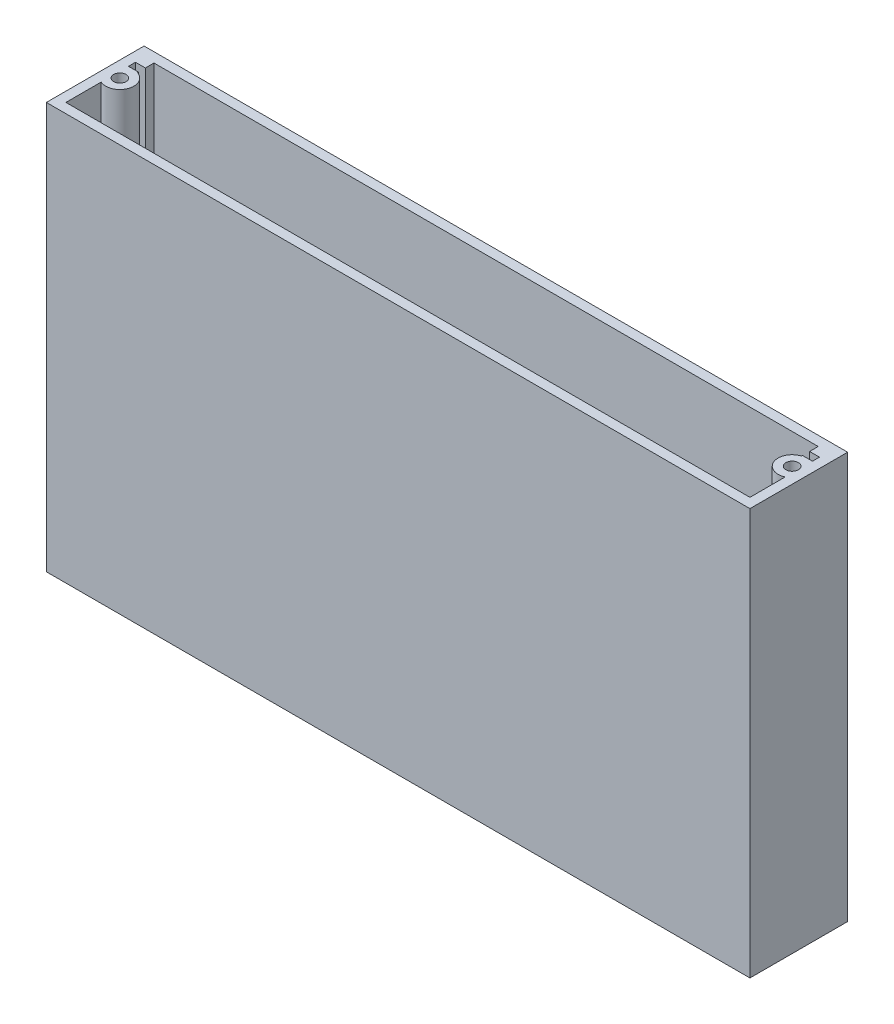
ISO-10303-21;
HEADER;
FILE_DESCRIPTION(('STEP AP214'),'2;1');
FILE_NAME('part.step','',(''),(''),'','','');
FILE_SCHEMA(('AUTOMOTIVE_DESIGN { 1 0 10303 214 1 1 1 1 }'));
ENDSEC;
DATA;
#1=APPLICATION_CONTEXT('core data for automotive mechanical design processes');
#2=APPLICATION_PROTOCOL_DEFINITION('international standard','automotive_design',2000,#1);
#3=PRODUCT_CONTEXT('',#1,'mechanical');
#4=PRODUCT('Part','Part','',(#3));
#5=PRODUCT_RELATED_PRODUCT_CATEGORY('part','',(#4));
#6=PRODUCT_DEFINITION_FORMATION('','',#4);
#7=PRODUCT_DEFINITION_CONTEXT('part definition',#1,'design');
#8=PRODUCT_DEFINITION('design','',#6,#7);
#9=PRODUCT_DEFINITION_SHAPE('','',#8);
#10=(LENGTH_UNIT() NAMED_UNIT(*) SI_UNIT(.MILLI.,.METRE.));
#11=(NAMED_UNIT(*) PLANE_ANGLE_UNIT() SI_UNIT($,.RADIAN.));
#12=(NAMED_UNIT(*) SI_UNIT($,.STERADIAN.) SOLID_ANGLE_UNIT());
#13=UNCERTAINTY_MEASURE_WITH_UNIT(LENGTH_MEASURE(1.E-05),#10,'distance_accuracy_value','');
#14=(GEOMETRIC_REPRESENTATION_CONTEXT(3) GLOBAL_UNCERTAINTY_ASSIGNED_CONTEXT((#13)) GLOBAL_UNIT_ASSIGNED_CONTEXT((#10,
#11,#12)) REPRESENTATION_CONTEXT('',''));
#15=CARTESIAN_POINT('',(0.,0.,0.));
#16=DIRECTION('',(0.,0.,1.));
#17=DIRECTION('',(1.,0.,0.));
#18=AXIS2_PLACEMENT_3D('',#15,#16,#17);
#19=CARTESIAN_POINT('',(225.425,3.17500000000001,-3.175));
#20=DIRECTION('',(1.,0.,0.));
#21=DIRECTION('',(0.,0.,-1.));
#22=AXIS2_PLACEMENT_3D('',#19,#20,#21);
#23=PLANE('',#22);
#24=DIRECTION('',(0.,-1.,0.));
#25=VECTOR('',#24,1.);
#26=CARTESIAN_POINT('',(225.425,145.01156881434,-14.6397806843238));
#27=LINE('',#26,#25);
#28=CARTESIAN_POINT('',(225.425,3.17500000000001,-14.6397806843238));
#29=VERTEX_POINT('',#28);
#30=CARTESIAN_POINT('',(225.425,132.08,-14.6397806843238));
#31=VERTEX_POINT('',#30);
#32=EDGE_CURVE('E174',#29,#31,#27,.F.);
#33=ORIENTED_EDGE('',*,*,#32,.F.);
#34=DIRECTION('',(0.,0.,-1.));
#35=VECTOR('',#34,1.);
#36=CARTESIAN_POINT('',(225.425,3.17500000000001,-3.175));
#37=LINE('',#36,#35);
#38=CARTESIAN_POINT('',(225.425,3.17500000000001,-3.175));
#39=VERTEX_POINT('',#38);
#40=EDGE_CURVE('E326',#39,#29,#37,.T.);
#41=ORIENTED_EDGE('',*,*,#40,.F.);
#42=DIRECTION('',(0.,1.,0.));
#43=VECTOR('',#42,1.);
#44=CARTESIAN_POINT('',(225.425,3.17500000000001,-3.175));
#45=LINE('',#44,#43);
#46=CARTESIAN_POINT('',(225.425,132.08,-3.175));
#47=VERTEX_POINT('',#46);
#48=EDGE_CURVE('E195',#39,#47,#45,.T.);
#49=ORIENTED_EDGE('',*,*,#48,.T.);
#50=DIRECTION('',(0.,0.,-1.));
#51=VECTOR('',#50,1.);
#52=CARTESIAN_POINT('',(225.425,132.08,-3.175));
#53=LINE('',#52,#51);
#54=EDGE_CURVE('E191',#47,#31,#53,.T.);
#55=ORIENTED_EDGE('',*,*,#54,.T.);
#56=EDGE_LOOP('',(#33,#41,#49,#55));
#57=FACE_BOUND('',#56,.T.);
#58=ADVANCED_FACE('F37',(#57),#23,.F.);
#59=CARTESIAN_POINT('',(222.208000312942,138.092943288152,-18.415));
#60=DIRECTION('',(-1.,0.,0.));
#61=DIRECTION('',(0.,0.,1.));
#62=AXIS2_PLACEMENT_3D('',#59,#60,#61);
#63=PLANE('',#62);
#64=DIRECTION('',(0.,0.,-1.));
#65=VECTOR('',#64,1.);
#66=CARTESIAN_POINT('',(222.208000312942,3.17500000000001,-18.415));
#67=LINE('',#66,#65);
#68=CARTESIAN_POINT('',(222.208000312942,3.17500000000001,-23.1757078465532));
#69=VERTEX_POINT('',#68);
#70=CARTESIAN_POINT('',(222.208000312942,3.17500000000001,-23.495));
#71=VERTEX_POINT('',#70);
#72=EDGE_CURVE('E262',#69,#71,#67,.T.);
#73=ORIENTED_EDGE('',*,*,#72,.F.);
#74=DIRECTION('',(0.,-1.,0.));
#75=VECTOR('',#74,1.);
#76=CARTESIAN_POINT('',(222.208000312942,145.01156881434,-23.1757078465532));
#77=LINE('',#76,#75);
#78=CARTESIAN_POINT('',(222.208000312942,132.08,-23.1757078465532));
#79=VERTEX_POINT('',#78);
#80=EDGE_CURVE('E11',#69,#79,#77,.F.);
#81=ORIENTED_EDGE('',*,*,#80,.T.);
#82=DIRECTION('',(0.,0.,1.));
#83=VECTOR('',#82,1.);
#84=CARTESIAN_POINT('',(222.208000312942,132.08,-18.415));
#85=LINE('',#84,#83);
#86=CARTESIAN_POINT('',(222.208000312942,132.08,-23.495));
#87=VERTEX_POINT('',#86);
#88=EDGE_CURVE('E193',#87,#79,#85,.T.);
#89=ORIENTED_EDGE('',*,*,#88,.F.);
#90=DIRECTION('',(0.,-1.,0.));
#91=VECTOR('',#90,1.);
#92=CARTESIAN_POINT('',(222.208000312942,138.092943288152,-23.495));
#93=LINE('',#92,#91);
#94=EDGE_CURVE('E264',#87,#71,#93,.T.);
#95=ORIENTED_EDGE('',*,*,#94,.T.);
#96=EDGE_LOOP('',(#73,#81,#89,#95));
#97=FACE_BOUND('',#96,.T.);
#98=ADVANCED_FACE('F341',(#97),#63,.T.);
#99=CARTESIAN_POINT('',(3.175,3.17500000000001,-3.175));
#100=DIRECTION('',(-1.,0.,0.));
#101=DIRECTION('',(0.,0.,1.));
#102=AXIS2_PLACEMENT_3D('',#99,#100,#101);
#103=PLANE('',#102);
#104=DIRECTION('',(0.,-1.,0.));
#105=VECTOR('',#104,1.);
#106=CARTESIAN_POINT('',(3.175,145.01156881434,-14.6397806843238));
#107=LINE('',#106,#105);
#108=CARTESIAN_POINT('',(3.175,132.08,-14.6397806843238));
#109=VERTEX_POINT('',#108);
#110=CARTESIAN_POINT('',(3.175,3.17500000000001,-14.6397806843238));
#111=VERTEX_POINT('',#110);
#112=EDGE_CURVE('E59',#109,#111,#107,.T.);
#113=ORIENTED_EDGE('',*,*,#112,.F.);
#114=DIRECTION('',(0.,0.,1.));
#115=VECTOR('',#114,1.);
#116=CARTESIAN_POINT('',(3.175,132.08,-3.175));
#117=LINE('',#116,#115);
#118=CARTESIAN_POINT('',(3.175,132.08,-3.175));
#119=VERTEX_POINT('',#118);
#120=EDGE_CURVE('E250',#109,#119,#117,.T.);
#121=ORIENTED_EDGE('',*,*,#120,.T.);
#122=DIRECTION('',(0.,1.,0.));
#123=VECTOR('',#122,1.);
#124=CARTESIAN_POINT('',(3.175,3.17500000000001,-3.175));
#125=LINE('',#124,#123);
#126=CARTESIAN_POINT('',(3.175,3.17500000000001,-3.175));
#127=VERTEX_POINT('',#126);
#128=EDGE_CURVE('E208',#127,#119,#125,.T.);
#129=ORIENTED_EDGE('',*,*,#128,.F.);
#130=DIRECTION('',(0.,0.,1.));
#131=VECTOR('',#130,1.);
#132=CARTESIAN_POINT('',(3.175,3.17500000000001,-3.175));
#133=LINE('',#132,#131);
#134=EDGE_CURVE('E200',#111,#127,#133,.T.);
#135=ORIENTED_EDGE('',*,*,#134,.F.);
#136=EDGE_LOOP('',(#113,#121,#129,#135));
#137=FACE_BOUND('',#136,.T.);
#138=ADVANCED_FACE('F332',(#137),#103,.F.);
#139=CARTESIAN_POINT('',(6.39199968705793,138.092943288152,-18.415));
#140=DIRECTION('',(-1.,0.,0.));
#141=DIRECTION('',(0.,0.,1.));
#142=AXIS2_PLACEMENT_3D('',#139,#140,#141);
#143=PLANE('',#142);
#144=DIRECTION('',(0.,-1.,0.));
#145=VECTOR('',#144,1.);
#146=CARTESIAN_POINT('',(6.39199968705793,145.01156881434,-23.1757078465532));
#147=LINE('',#146,#145);
#148=CARTESIAN_POINT('',(6.39199968705793,3.17500000000001,-23.1757078465532));
#149=VERTEX_POINT('',#148);
#150=CARTESIAN_POINT('',(6.39199968705793,132.08,-23.1757078465532));
#151=VERTEX_POINT('',#150);
#152=EDGE_CURVE('E45',#149,#151,#147,.F.);
#153=ORIENTED_EDGE('',*,*,#152,.F.);
#154=DIRECTION('',(0.,0.,-1.));
#155=VECTOR('',#154,1.);
#156=CARTESIAN_POINT('',(6.39199968705793,3.17500000000001,-18.415));
#157=LINE('',#156,#155);
#158=CARTESIAN_POINT('',(6.39199968705793,3.17500000000001,-23.495));
#159=VERTEX_POINT('',#158);
#160=EDGE_CURVE('E285',#149,#159,#157,.T.);
#161=ORIENTED_EDGE('',*,*,#160,.T.);
#162=DIRECTION('',(0.,-1.,0.));
#163=VECTOR('',#162,1.);
#164=CARTESIAN_POINT('',(6.39199968705793,138.092943288152,-23.495));
#165=LINE('',#164,#163);
#166=CARTESIAN_POINT('',(6.39199968705793,132.08,-23.495));
#167=VERTEX_POINT('',#166);
#168=EDGE_CURVE('E295',#167,#159,#165,.T.);
#169=ORIENTED_EDGE('',*,*,#168,.F.);
#170=DIRECTION('',(0.,0.,1.));
#171=VECTOR('',#170,1.);
#172=CARTESIAN_POINT('',(6.39199968705793,132.08,-18.415));
#173=LINE('',#172,#171);
#174=EDGE_CURVE('E248',#167,#151,#173,.T.);
#175=ORIENTED_EDGE('',*,*,#174,.T.);
#176=EDGE_LOOP('',(#153,#161,#169,#175));
#177=FACE_BOUND('',#176,.T.);
#178=ADVANCED_FACE('F380',(#177),#143,.F.);
#179=CARTESIAN_POINT('',(225.425,3.17500000000001,-23.495));
#180=VERTEX_POINT('',#179);
#181=CARTESIAN_POINT('',(225.425,3.17500000000001,-25.781));
#182=VERTEX_POINT('',#181);
#183=EDGE_CURVE('E325',#180,#182,#37,.T.);
#184=ORIENTED_EDGE('',*,*,#183,.F.);
#185=DIRECTION('',(0.,-1.,0.));
#186=VECTOR('',#185,1.);
#187=CARTESIAN_POINT('',(225.425,138.092943288152,-23.495));
#188=LINE('',#187,#186);
#189=CARTESIAN_POINT('',(225.425,132.08,-23.495));
#190=VERTEX_POINT('',#189);
#191=EDGE_CURVE('E258',#190,#180,#188,.T.);
#192=ORIENTED_EDGE('',*,*,#191,.F.);
#193=CARTESIAN_POINT('',(225.425,132.08,-25.781));
#194=VERTEX_POINT('',#193);
#195=EDGE_CURVE('E198',#190,#194,#53,.T.);
#196=ORIENTED_EDGE('',*,*,#195,.T.);
#197=DIRECTION('',(0.,-1.,0.));
#198=VECTOR('',#197,1.);
#199=CARTESIAN_POINT('',(225.425,138.092943288152,-25.781));
#200=LINE('',#199,#198);
#201=EDGE_CURVE('E276',#194,#182,#200,.T.);
#202=ORIENTED_EDGE('',*,*,#201,.T.);
#203=EDGE_LOOP('',(#184,#192,#196,#202));
#204=FACE_BOUND('',#203,.T.);
#205=ADVANCED_FACE('F350',(#204),#23,.F.);
#206=DIRECTION('',(0.,-1.,0.));
#207=VECTOR('',#206,1.);
#208=CARTESIAN_POINT('',(3.175,138.092943288152,-23.495));
#209=LINE('',#208,#207);
#210=CARTESIAN_POINT('',(3.175,132.08,-23.495));
#211=VERTEX_POINT('',#210);
#212=CARTESIAN_POINT('',(3.175,3.17500000000001,-23.495));
#213=VERTEX_POINT('',#212);
#214=EDGE_CURVE('E293',#211,#213,#209,.T.);
#215=ORIENTED_EDGE('',*,*,#214,.T.);
#216=CARTESIAN_POINT('',(3.175,3.17500000000001,-25.781));
#217=VERTEX_POINT('',#216);
#218=EDGE_CURVE('E319',#217,#213,#133,.T.);
#219=ORIENTED_EDGE('',*,*,#218,.F.);
#220=DIRECTION('',(0.,-1.,0.));
#221=VECTOR('',#220,1.);
#222=CARTESIAN_POINT('',(3.175,138.092943288152,-25.781));
#223=LINE('',#222,#221);
#224=CARTESIAN_POINT('',(3.175,132.08,-25.781));
#225=VERTEX_POINT('',#224);
#226=EDGE_CURVE('E303',#225,#217,#223,.T.);
#227=ORIENTED_EDGE('',*,*,#226,.F.);
#228=EDGE_CURVE('E328',#225,#211,#117,.T.);
#229=ORIENTED_EDGE('',*,*,#228,.T.);
#230=EDGE_LOOP('',(#215,#219,#227,#229));
#231=FACE_BOUND('',#230,.T.);
#232=ADVANCED_FACE('F375',(#231),#103,.F.);
#233=CARTESIAN_POINT('',(0.,3.17500000000001,0.));
#234=DIRECTION('',(0.,-1.,0.));
#235=DIRECTION('',(0.,0.,-1.));
#236=AXIS2_PLACEMENT_3D('',#233,#234,#235);
#237=PLANE('',#236);
#238=CARTESIAN_POINT('',(223.52,3.17500000000001,-18.796));
#239=DIRECTION('',(0.,1.,0.));
#240=DIRECTION('',(0.,0.,1.));
#241=AXIS2_PLACEMENT_3D('',#238,#239,#240);
#242=CIRCLE('',#241,4.57199999999999);
#243=EDGE_CURVE('E179',#69,#29,#242,.T.);
#244=ORIENTED_EDGE('',*,*,#243,.F.);
#245=ORIENTED_EDGE('',*,*,#72,.T.);
#246=DIRECTION('',(1.,0.,0.));
#247=VECTOR('',#246,1.);
#248=CARTESIAN_POINT('',(225.425,3.17500000000001,-23.495));
#249=LINE('',#248,#247);
#250=EDGE_CURVE('E252',#71,#180,#249,.T.);
#251=ORIENTED_EDGE('',*,*,#250,.T.);
#252=ORIENTED_EDGE('',*,*,#183,.T.);
#253=DIRECTION('',(-1.,0.,0.));
#254=VECTOR('',#253,1.);
#255=CARTESIAN_POINT('',(225.425,3.17500000000001,-25.781));
#256=LINE('',#255,#254);
#257=CARTESIAN_POINT('',(222.208000312942,3.17500000000001,-25.781));
#258=VERTEX_POINT('',#257);
#259=EDGE_CURVE('E274',#182,#258,#256,.T.);
#260=ORIENTED_EDGE('',*,*,#259,.T.);
#261=DIRECTION('',(0.,0.,-1.));
#262=VECTOR('',#261,1.);
#263=CARTESIAN_POINT('',(222.208000312942,3.17500000000001,-25.781));
#264=LINE('',#263,#262);
#265=CARTESIAN_POINT('',(222.208000312942,3.17500000000001,-28.575));
#266=VERTEX_POINT('',#265);
#267=EDGE_CURVE('E260',#258,#266,#264,.T.);
#268=ORIENTED_EDGE('',*,*,#267,.T.);
#269=DIRECTION('',(-1.,0.,0.));
#270=VECTOR('',#269,1.);
#271=CARTESIAN_POINT('',(3.175,3.17500000000001,-28.575));
#272=LINE('',#271,#270);
#273=CARTESIAN_POINT('',(6.39199968705793,3.17500000000001,-28.575));
#274=VERTEX_POINT('',#273);
#275=EDGE_CURVE('E211',#266,#274,#272,.T.);
#276=ORIENTED_EDGE('',*,*,#275,.T.);
#277=DIRECTION('',(0.,0.,-1.));
#278=VECTOR('',#277,1.);
#279=CARTESIAN_POINT('',(6.39199968705793,3.17500000000001,-25.781));
#280=LINE('',#279,#278);
#281=CARTESIAN_POINT('',(6.39199968705793,3.17500000000001,-25.781));
#282=VERTEX_POINT('',#281);
#283=EDGE_CURVE('E309',#282,#274,#280,.T.);
#284=ORIENTED_EDGE('',*,*,#283,.F.);
#285=DIRECTION('',(1.,0.,0.));
#286=VECTOR('',#285,1.);
#287=CARTESIAN_POINT('',(3.175,3.17500000000001,-25.781));
#288=LINE('',#287,#286);
#289=EDGE_CURVE('E287',#217,#282,#288,.T.);
#290=ORIENTED_EDGE('',*,*,#289,.F.);
#291=ORIENTED_EDGE('',*,*,#218,.T.);
#292=DIRECTION('',(-1.,0.,0.));
#293=VECTOR('',#292,1.);
#294=CARTESIAN_POINT('',(3.175,3.17500000000001,-23.495));
#295=LINE('',#294,#293);
#296=EDGE_CURVE('E290',#159,#213,#295,.T.);
#297=ORIENTED_EDGE('',*,*,#296,.F.);
#298=ORIENTED_EDGE('',*,*,#160,.F.);
#299=CARTESIAN_POINT('',(5.08,3.17500000000001,-18.796));
#300=DIRECTION('',(0.,1.,0.));
#301=DIRECTION('',(0.,0.,1.));
#302=AXIS2_PLACEMENT_3D('',#299,#300,#301);
#303=CIRCLE('',#302,4.572);
#304=EDGE_CURVE('E52',#111,#149,#303,.T.);
#305=ORIENTED_EDGE('',*,*,#304,.F.);
#306=ORIENTED_EDGE('',*,*,#134,.T.);
#307=DIRECTION('',(1.,0.,0.));
#308=VECTOR('',#307,1.);
#309=CARTESIAN_POINT('',(3.175,3.17500000000001,-3.175));
#310=LINE('',#309,#308);
#311=EDGE_CURVE('E322',#127,#39,#310,.T.);
#312=ORIENTED_EDGE('',*,*,#311,.T.);
#313=ORIENTED_EDGE('',*,*,#40,.T.);
#314=EDGE_LOOP('',(#244,#245,#251,#252,#260,#268,#276,#284,#290,#291,#297,#298,#305,#306,#312,#313));
#315=FACE_BOUND('',#314,.T.);
#316=ADVANCED_FACE('F336',(#315),#237,.F.);
#317=CARTESIAN_POINT('',(3.175,3.17500000000001,-28.575));
#318=DIRECTION('',(0.,0.,-1.));
#319=DIRECTION('',(-1.,0.,0.));
#320=AXIS2_PLACEMENT_3D('',#317,#318,#319);
#321=PLANE('',#320);
#322=ORIENTED_EDGE('',*,*,#275,.F.);
#323=DIRECTION('',(0.,1.,0.));
#324=VECTOR('',#323,1.);
#325=CARTESIAN_POINT('',(222.208000312942,3.17500000000001,-28.575));
#326=LINE('',#325,#324);
#327=CARTESIAN_POINT('',(222.208000312942,132.08,-28.575));
#328=VERTEX_POINT('',#327);
#329=EDGE_CURVE('E283',#266,#328,#326,.T.);
#330=ORIENTED_EDGE('',*,*,#329,.T.);
#331=DIRECTION('',(-1.,0.,0.));
#332=VECTOR('',#331,1.);
#333=CARTESIAN_POINT('',(3.175,132.08,-28.575));
#334=LINE('',#333,#332);
#335=CARTESIAN_POINT('',(6.39199968705793,132.08,-28.575));
#336=VERTEX_POINT('',#335);
#337=EDGE_CURVE('E197',#328,#336,#334,.T.);
#338=ORIENTED_EDGE('',*,*,#337,.T.);
#339=DIRECTION('',(0.,1.,0.));
#340=VECTOR('',#339,1.);
#341=CARTESIAN_POINT('',(6.39199968705793,3.17500000000001,-28.575));
#342=LINE('',#341,#340);
#343=EDGE_CURVE('E306',#274,#336,#342,.T.);
#344=ORIENTED_EDGE('',*,*,#343,.F.);
#345=EDGE_LOOP('',(#322,#330,#338,#344));
#346=FACE_BOUND('',#345,.T.);
#347=ADVANCED_FACE('F363',(#346),#321,.F.);
#348=CARTESIAN_POINT('',(0.,132.08,0.));
#349=DIRECTION('',(1.,0.,0.));
#350=DIRECTION('',(0.,0.,-1.));
#351=AXIS2_PLACEMENT_3D('',#348,#349,#350);
#352=PLANE('',#351);
#353=DIRECTION('',(0.,0.,1.));
#354=VECTOR('',#353,1.);
#355=CARTESIAN_POINT('',(0.,0.,0.));
#356=LINE('',#355,#354);
#357=CARTESIAN_POINT('',(0.,0.,-31.75));
#358=VERTEX_POINT('',#357);
#359=CARTESIAN_POINT('',(0.,0.,0.));
#360=VERTEX_POINT('',#359);
#361=EDGE_CURVE('E207',#358,#360,#356,.T.);
#362=ORIENTED_EDGE('',*,*,#361,.T.);
#363=DIRECTION('',(0.,-1.,0.));
#364=VECTOR('',#363,1.);
#365=CARTESIAN_POINT('',(0.,132.08,0.));
#366=LINE('',#365,#364);
#367=CARTESIAN_POINT('',(0.,132.08,0.));
#368=VERTEX_POINT('',#367);
#369=EDGE_CURVE('E238',#368,#360,#366,.T.);
#370=ORIENTED_EDGE('',*,*,#369,.F.);
#371=DIRECTION('',(0.,0.,1.));
#372=VECTOR('',#371,1.);
#373=CARTESIAN_POINT('',(0.,132.08,0.));
#374=LINE('',#373,#372);
#375=CARTESIAN_POINT('',(0.,132.08,-31.75));
#376=VERTEX_POINT('',#375);
#377=EDGE_CURVE('E212',#376,#368,#374,.T.);
#378=ORIENTED_EDGE('',*,*,#377,.F.);
#379=DIRECTION('',(0.,-1.,0.));
#380=VECTOR('',#379,1.);
#381=CARTESIAN_POINT('',(0.,132.08,-31.75));
#382=LINE('',#381,#380);
#383=EDGE_CURVE('E222',#376,#358,#382,.T.);
#384=ORIENTED_EDGE('',*,*,#383,.T.);
#385=EDGE_LOOP('',(#362,#370,#378,#384));
#386=FACE_BOUND('',#385,.T.);
#387=ADVANCED_FACE('F39',(#386),#352,.F.);
#388=CARTESIAN_POINT('',(0.,132.08,0.));
#389=DIRECTION('',(0.,0.,-1.));
#390=DIRECTION('',(-1.,0.,0.));
#391=AXIS2_PLACEMENT_3D('',#388,#389,#390);
#392=PLANE('',#391);
#393=DIRECTION('',(1.,0.,0.));
#394=VECTOR('',#393,1.);
#395=CARTESIAN_POINT('',(0.,0.,0.));
#396=LINE('',#395,#394);
#397=CARTESIAN_POINT('',(228.6,0.,0.));
#398=VERTEX_POINT('',#397);
#399=EDGE_CURVE('E225',#360,#398,#396,.T.);
#400=ORIENTED_EDGE('',*,*,#399,.T.);
#401=DIRECTION('',(0.,-1.,0.));
#402=VECTOR('',#401,1.);
#403=CARTESIAN_POINT('',(228.6,132.08,0.));
#404=LINE('',#403,#402);
#405=CARTESIAN_POINT('',(228.6,132.08,0.));
#406=VERTEX_POINT('',#405);
#407=EDGE_CURVE('E235',#406,#398,#404,.T.);
#408=ORIENTED_EDGE('',*,*,#407,.F.);
#409=DIRECTION('',(1.,0.,0.));
#410=VECTOR('',#409,1.);
#411=CARTESIAN_POINT('',(0.,132.08,0.));
#412=LINE('',#411,#410);
#413=EDGE_CURVE('E215',#368,#406,#412,.T.);
#414=ORIENTED_EDGE('',*,*,#413,.F.);
#415=ORIENTED_EDGE('',*,*,#369,.T.);
#416=EDGE_LOOP('',(#400,#408,#414,#415));
#417=FACE_BOUND('',#416,.T.);
#418=ADVANCED_FACE('F415',(#417),#392,.F.);
#419=CARTESIAN_POINT('',(228.6,132.08,0.));
#420=DIRECTION('',(-1.,0.,0.));
#421=DIRECTION('',(0.,0.,1.));
#422=AXIS2_PLACEMENT_3D('',#419,#420,#421);
#423=PLANE('',#422);
#424=DIRECTION('',(0.,0.,-1.));
#425=VECTOR('',#424,1.);
#426=CARTESIAN_POINT('',(228.6,0.,0.));
#427=LINE('',#426,#425);
#428=CARTESIAN_POINT('',(228.6,0.,-31.75));
#429=VERTEX_POINT('',#428);
#430=EDGE_CURVE('E227',#398,#429,#427,.T.);
#431=ORIENTED_EDGE('',*,*,#430,.T.);
#432=DIRECTION('',(0.,-1.,0.));
#433=VECTOR('',#432,1.);
#434=CARTESIAN_POINT('',(228.6,132.08,-31.75));
#435=LINE('',#434,#433);
#436=CARTESIAN_POINT('',(228.6,132.08,-31.75));
#437=VERTEX_POINT('',#436);
#438=EDGE_CURVE('E232',#437,#429,#435,.T.);
#439=ORIENTED_EDGE('',*,*,#438,.F.);
#440=DIRECTION('',(0.,0.,-1.));
#441=VECTOR('',#440,1.);
#442=CARTESIAN_POINT('',(228.6,132.08,0.));
#443=LINE('',#442,#441);
#444=EDGE_CURVE('E218',#406,#437,#443,.T.);
#445=ORIENTED_EDGE('',*,*,#444,.F.);
#446=ORIENTED_EDGE('',*,*,#407,.T.);
#447=EDGE_LOOP('',(#431,#439,#445,#446));
#448=FACE_BOUND('',#447,.T.);
#449=ADVANCED_FACE('F412',(#448),#423,.F.);
#450=CARTESIAN_POINT('',(0.,132.08,-31.75));
#451=DIRECTION('',(0.,0.,1.));
#452=DIRECTION('',(1.,0.,0.));
#453=AXIS2_PLACEMENT_3D('',#450,#451,#452);
#454=PLANE('',#453);
#455=DIRECTION('',(-1.,0.,0.));
#456=VECTOR('',#455,1.);
#457=CARTESIAN_POINT('',(0.,0.,-31.75));
#458=LINE('',#457,#456);
#459=EDGE_CURVE('E216',#429,#358,#458,.T.);
#460=ORIENTED_EDGE('',*,*,#459,.T.);
#461=ORIENTED_EDGE('',*,*,#383,.F.);
#462=DIRECTION('',(-1.,0.,0.));
#463=VECTOR('',#462,1.);
#464=CARTESIAN_POINT('',(0.,132.08,-31.75));
#465=LINE('',#464,#463);
#466=EDGE_CURVE('E220',#437,#376,#465,.T.);
#467=ORIENTED_EDGE('',*,*,#466,.F.);
#468=ORIENTED_EDGE('',*,*,#438,.T.);
#469=EDGE_LOOP('',(#460,#461,#467,#468));
#470=FACE_BOUND('',#469,.T.);
#471=ADVANCED_FACE('F405',(#470),#454,.F.);
#472=CARTESIAN_POINT('',(0.,132.08,0.));
#473=DIRECTION('',(0.,-1.,0.));
#474=DIRECTION('',(0.,0.,-1.));
#475=AXIS2_PLACEMENT_3D('',#472,#473,#474);
#476=PLANE('',#475);
#477=CARTESIAN_POINT('',(5.08,132.08,-18.796));
#478=DIRECTION('',(0.,1.,0.));
#479=DIRECTION('',(0.,0.,1.));
#480=AXIS2_PLACEMENT_3D('',#477,#478,#479);
#481=CIRCLE('',#480,2.032);
#482=CARTESIAN_POINT('',(5.08,132.08,-16.764));
#483=VERTEX_POINT('',#482);
#484=EDGE_CURVE('E638',#483,#483,#481,.T.);
#485=ORIENTED_EDGE('',*,*,#484,.F.);
#486=EDGE_LOOP('',(#485));
#487=FACE_BOUND('',#486,.T.);
#488=CARTESIAN_POINT('',(223.52,132.08,-18.796));
#489=DIRECTION('',(0.,1.,0.));
#490=DIRECTION('',(0.,0.,1.));
#491=AXIS2_PLACEMENT_3D('',#488,#489,#490);
#492=CIRCLE('',#491,2.03200000000001);
#493=CARTESIAN_POINT('',(223.52,132.08,-16.764));
#494=VERTEX_POINT('',#493);
#495=EDGE_CURVE('E646',#494,#494,#492,.T.);
#496=ORIENTED_EDGE('',*,*,#495,.F.);
#497=EDGE_LOOP('',(#496));
#498=FACE_BOUND('',#497,.T.);
#499=ORIENTED_EDGE('',*,*,#88,.T.);
#500=CARTESIAN_POINT('',(223.52,132.08,-18.796));
#501=DIRECTION('',(0.,-1.,0.));
#502=DIRECTION('',(0.,0.,-1.));
#503=AXIS2_PLACEMENT_3D('',#500,#501,#502);
#504=CIRCLE('',#503,4.57199999999999);
#505=EDGE_CURVE('E177',#31,#79,#504,.T.);
#506=ORIENTED_EDGE('',*,*,#505,.F.);
#507=ORIENTED_EDGE('',*,*,#54,.F.);
#508=DIRECTION('',(1.,0.,0.));
#509=VECTOR('',#508,1.);
#510=CARTESIAN_POINT('',(3.175,132.08,-3.175));
#511=LINE('',#510,#509);
#512=EDGE_CURVE('E202',#119,#47,#511,.T.);
#513=ORIENTED_EDGE('',*,*,#512,.F.);
#514=ORIENTED_EDGE('',*,*,#120,.F.);
#515=CARTESIAN_POINT('',(5.08,132.08,-18.796));
#516=DIRECTION('',(0.,-1.,0.));
#517=DIRECTION('',(0.,0.,-1.));
#518=AXIS2_PLACEMENT_3D('',#515,#516,#517);
#519=CIRCLE('',#518,4.572);
#520=EDGE_CURVE('E245',#151,#109,#519,.T.);
#521=ORIENTED_EDGE('',*,*,#520,.F.);
#522=ORIENTED_EDGE('',*,*,#174,.F.);
#523=DIRECTION('',(1.,0.,0.));
#524=VECTOR('',#523,1.);
#525=CARTESIAN_POINT('',(3.175,132.08,-23.495));
#526=LINE('',#525,#524);
#527=EDGE_CURVE('E288',#211,#167,#526,.T.);
#528=ORIENTED_EDGE('',*,*,#527,.F.);
#529=ORIENTED_EDGE('',*,*,#228,.F.);
#530=DIRECTION('',(-1.,0.,0.));
#531=VECTOR('',#530,1.);
#532=CARTESIAN_POINT('',(3.175,132.08,-25.781));
#533=LINE('',#532,#531);
#534=CARTESIAN_POINT('',(6.39199968705793,132.08,-25.781));
#535=VERTEX_POINT('',#534);
#536=EDGE_CURVE('E302',#535,#225,#533,.T.);
#537=ORIENTED_EDGE('',*,*,#536,.F.);
#538=DIRECTION('',(0.,0.,1.));
#539=VECTOR('',#538,1.);
#540=CARTESIAN_POINT('',(6.39199968705793,132.08,-25.781));
#541=LINE('',#540,#539);
#542=EDGE_CURVE('E300',#336,#535,#541,.T.);
#543=ORIENTED_EDGE('',*,*,#542,.F.);
#544=ORIENTED_EDGE('',*,*,#337,.F.);
#545=DIRECTION('',(0.,0.,1.));
#546=VECTOR('',#545,1.);
#547=CARTESIAN_POINT('',(222.208000312942,132.08,-25.781));
#548=LINE('',#547,#546);
#549=CARTESIAN_POINT('',(222.208000312942,132.08,-25.781));
#550=VERTEX_POINT('',#549);
#551=EDGE_CURVE('E269',#328,#550,#548,.T.);
#552=ORIENTED_EDGE('',*,*,#551,.T.);
#553=DIRECTION('',(1.,0.,0.));
#554=VECTOR('',#553,1.);
#555=CARTESIAN_POINT('',(225.425,132.08,-25.781));
#556=LINE('',#555,#554);
#557=EDGE_CURVE('E271',#550,#194,#556,.T.);
#558=ORIENTED_EDGE('',*,*,#557,.T.);
#559=ORIENTED_EDGE('',*,*,#195,.F.);
#560=DIRECTION('',(-1.,0.,0.));
#561=VECTOR('',#560,1.);
#562=CARTESIAN_POINT('',(225.425,132.08,-23.495));
#563=LINE('',#562,#561);
#564=EDGE_CURVE('E257',#190,#87,#563,.T.);
#565=ORIENTED_EDGE('',*,*,#564,.T.);
#566=EDGE_LOOP('',(#499,#506,#507,#513,#514,#521,#522,#528,#529,#537,#543,#544,#552,#558,#559,#565));
#567=FACE_BOUND('',#566,.T.);
#568=ORIENTED_EDGE('',*,*,#377,.T.);
#569=ORIENTED_EDGE('',*,*,#413,.T.);
#570=ORIENTED_EDGE('',*,*,#444,.T.);
#571=ORIENTED_EDGE('',*,*,#466,.T.);
#572=EDGE_LOOP('',(#568,#569,#570,#571));
#573=FACE_BOUND('',#572,.T.);
#574=ADVANCED_FACE('F188',(#487,#498,#567,#573),#476,.F.);
#575=CARTESIAN_POINT('',(0.,0.,0.));
#576=DIRECTION('',(0.,-1.,0.));
#577=DIRECTION('',(0.,0.,-1.));
#578=AXIS2_PLACEMENT_3D('',#575,#576,#577);
#579=PLANE('',#578);
#580=ORIENTED_EDGE('',*,*,#361,.F.);
#581=ORIENTED_EDGE('',*,*,#459,.F.);
#582=ORIENTED_EDGE('',*,*,#430,.F.);
#583=ORIENTED_EDGE('',*,*,#399,.F.);
#584=EDGE_LOOP('',(#580,#581,#582,#583));
#585=FACE_BOUND('',#584,.T.);
#586=ADVANCED_FACE('F400',(#585),#579,.T.);
#587=CARTESIAN_POINT('',(3.175,3.17500000000001,-3.175));
#588=DIRECTION('',(0.,0.,1.));
#589=DIRECTION('',(1.,0.,0.));
#590=AXIS2_PLACEMENT_3D('',#587,#588,#589);
#591=PLANE('',#590);
#592=ORIENTED_EDGE('',*,*,#512,.T.);
#593=ORIENTED_EDGE('',*,*,#48,.F.);
#594=ORIENTED_EDGE('',*,*,#311,.F.);
#595=ORIENTED_EDGE('',*,*,#128,.T.);
#596=EDGE_LOOP('',(#592,#593,#594,#595));
#597=FACE_BOUND('',#596,.T.);
#598=ADVANCED_FACE('F335',(#597),#591,.F.);
#599=CARTESIAN_POINT('',(6.39199968705793,138.092943288152,-25.781));
#600=DIRECTION('',(-1.,0.,0.));
#601=DIRECTION('',(0.,0.,1.));
#602=AXIS2_PLACEMENT_3D('',#599,#600,#601);
#603=PLANE('',#602);
#604=ORIENTED_EDGE('',*,*,#283,.T.);
#605=ORIENTED_EDGE('',*,*,#343,.T.);
#606=ORIENTED_EDGE('',*,*,#542,.T.);
#607=DIRECTION('',(0.,-1.,0.));
#608=VECTOR('',#607,1.);
#609=CARTESIAN_POINT('',(6.39199968705793,138.092943288152,-25.781));
#610=LINE('',#609,#608);
#611=EDGE_CURVE('E312',#535,#282,#610,.T.);
#612=ORIENTED_EDGE('',*,*,#611,.T.);
#613=EDGE_LOOP('',(#604,#605,#606,#612));
#614=FACE_BOUND('',#613,.T.);
#615=ADVANCED_FACE('F370',(#614),#603,.F.);
#616=CARTESIAN_POINT('',(3.175,138.092943288152,-25.781));
#617=DIRECTION('',(0.,0.,-1.));
#618=DIRECTION('',(-1.,0.,0.));
#619=AXIS2_PLACEMENT_3D('',#616,#617,#618);
#620=PLANE('',#619);
#621=ORIENTED_EDGE('',*,*,#611,.F.);
#622=ORIENTED_EDGE('',*,*,#536,.T.);
#623=ORIENTED_EDGE('',*,*,#226,.T.);
#624=ORIENTED_EDGE('',*,*,#289,.T.);
#625=EDGE_LOOP('',(#621,#622,#623,#624));
#626=FACE_BOUND('',#625,.T.);
#627=ADVANCED_FACE('F377',(#626),#620,.F.);
#628=CARTESIAN_POINT('',(3.175,138.092943288152,-23.495));
#629=DIRECTION('',(0.,0.,1.));
#630=DIRECTION('',(1.,0.,0.));
#631=AXIS2_PLACEMENT_3D('',#628,#629,#630);
#632=PLANE('',#631);
#633=ORIENTED_EDGE('',*,*,#214,.F.);
#634=ORIENTED_EDGE('',*,*,#527,.T.);
#635=ORIENTED_EDGE('',*,*,#168,.T.);
#636=ORIENTED_EDGE('',*,*,#296,.T.);
#637=EDGE_LOOP('',(#633,#634,#635,#636));
#638=FACE_BOUND('',#637,.T.);
#639=ADVANCED_FACE('F379',(#638),#632,.F.);
#640=CARTESIAN_POINT('',(222.208000312942,138.092943288152,-25.781));
#641=DIRECTION('',(-1.,0.,0.));
#642=DIRECTION('',(0.,0.,1.));
#643=AXIS2_PLACEMENT_3D('',#640,#641,#642);
#644=PLANE('',#643);
#645=ORIENTED_EDGE('',*,*,#329,.F.);
#646=ORIENTED_EDGE('',*,*,#267,.F.);
#647=DIRECTION('',(0.,-1.,0.));
#648=VECTOR('',#647,1.);
#649=CARTESIAN_POINT('',(222.208000312942,138.092943288152,-25.781));
#650=LINE('',#649,#648);
#651=EDGE_CURVE('E272',#550,#258,#650,.T.);
#652=ORIENTED_EDGE('',*,*,#651,.F.);
#653=ORIENTED_EDGE('',*,*,#551,.F.);
#654=EDGE_LOOP('',(#645,#646,#652,#653));
#655=FACE_BOUND('',#654,.T.);
#656=ADVANCED_FACE('F366',(#655),#644,.T.);
#657=CARTESIAN_POINT('',(225.425,138.092943288152,-25.781));
#658=DIRECTION('',(0.,0.,1.));
#659=DIRECTION('',(1.,0.,0.));
#660=AXIS2_PLACEMENT_3D('',#657,#658,#659);
#661=PLANE('',#660);
#662=ORIENTED_EDGE('',*,*,#557,.F.);
#663=ORIENTED_EDGE('',*,*,#651,.T.);
#664=ORIENTED_EDGE('',*,*,#259,.F.);
#665=ORIENTED_EDGE('',*,*,#201,.F.);
#666=EDGE_LOOP('',(#662,#663,#664,#665));
#667=FACE_BOUND('',#666,.T.);
#668=ADVANCED_FACE('F355',(#667),#661,.T.);
#669=CARTESIAN_POINT('',(225.425,138.092943288152,-23.495));
#670=DIRECTION('',(0.,0.,-1.));
#671=DIRECTION('',(-1.,0.,0.));
#672=AXIS2_PLACEMENT_3D('',#669,#670,#671);
#673=PLANE('',#672);
#674=ORIENTED_EDGE('',*,*,#564,.F.);
#675=ORIENTED_EDGE('',*,*,#191,.T.);
#676=ORIENTED_EDGE('',*,*,#250,.F.);
#677=ORIENTED_EDGE('',*,*,#94,.F.);
#678=EDGE_LOOP('',(#674,#675,#676,#677));
#679=FACE_BOUND('',#678,.T.);
#680=ADVANCED_FACE('F346',(#679),#673,.T.);
#681=CARTESIAN_POINT('',(5.08,145.01156881434,-18.796));
#682=DIRECTION('',(0.,-1.,0.));
#683=DIRECTION('',(0.,0.,-1.));
#684=AXIS2_PLACEMENT_3D('',#681,#682,#683);
#685=CYLINDRICAL_SURFACE('',#684,4.572);
#686=ORIENTED_EDGE('',*,*,#520,.T.);
#687=ORIENTED_EDGE('',*,*,#112,.T.);
#688=ORIENTED_EDGE('',*,*,#304,.T.);
#689=ORIENTED_EDGE('',*,*,#152,.T.);
#690=EDGE_LOOP('',(#686,#687,#688,#689));
#691=FACE_BOUND('',#690,.T.);
#692=ADVANCED_FACE('F244',(#691),#685,.T.);
#693=CARTESIAN_POINT('',(223.52,145.01156881434,-18.796));
#694=DIRECTION('',(0.,-1.,0.));
#695=DIRECTION('',(0.,0.,-1.));
#696=AXIS2_PLACEMENT_3D('',#693,#694,#695);
#697=CYLINDRICAL_SURFACE('',#696,4.57199999999999);
#698=ORIENTED_EDGE('',*,*,#243,.T.);
#699=ORIENTED_EDGE('',*,*,#32,.T.);
#700=ORIENTED_EDGE('',*,*,#505,.T.);
#701=ORIENTED_EDGE('',*,*,#80,.F.);
#702=EDGE_LOOP('',(#698,#699,#700,#701));
#703=FACE_BOUND('',#702,.T.);
#704=ADVANCED_FACE('F176',(#703),#697,.T.);
#705=CARTESIAN_POINT('',(223.52,8.25500000000001,-18.796));
#706=DIRECTION('',(0.,1.,0.));
#707=DIRECTION('',(0.,0.,1.));
#708=AXIS2_PLACEMENT_3D('',#705,#706,#707);
#709=CYLINDRICAL_SURFACE('',#708,2.03200000000001);
#710=CARTESIAN_POINT('',(223.52,8.25500000000001,-18.796));
#711=DIRECTION('',(0.,1.,0.));
#712=DIRECTION('',(0.,0.,1.));
#713=AXIS2_PLACEMENT_3D('',#710,#711,#712);
#714=CIRCLE('',#713,2.03200000000001);
#715=CARTESIAN_POINT('',(223.52,8.25500000000001,-16.764));
#716=VERTEX_POINT('',#715);
#717=EDGE_CURVE('E641',#716,#716,#714,.T.);
#718=ORIENTED_EDGE('',*,*,#717,.F.);
#719=EDGE_LOOP('',(#718));
#720=FACE_BOUND('',#719,.T.);
#721=ORIENTED_EDGE('',*,*,#495,.T.);
#722=EDGE_LOOP('',(#721));
#723=FACE_BOUND('',#722,.T.);
#724=ADVANCED_FACE('F489',(#720,#723),#709,.F.);
#725=CARTESIAN_POINT('',(223.52,8.25500000000001,-18.796));
#726=DIRECTION('',(0.,1.,0.));
#727=DIRECTION('',(0.,0.,1.));
#728=AXIS2_PLACEMENT_3D('',#725,#726,#727);
#729=PLANE('',#728);
#730=ORIENTED_EDGE('',*,*,#717,.T.);
#731=EDGE_LOOP('',(#730));
#732=FACE_BOUND('',#731,.T.);
#733=ADVANCED_FACE('F497',(#732),#729,.T.);
#734=CARTESIAN_POINT('',(5.08,8.25500000000001,-18.796));
#735=DIRECTION('',(0.,1.,0.));
#736=DIRECTION('',(0.,0.,1.));
#737=AXIS2_PLACEMENT_3D('',#734,#735,#736);
#738=CYLINDRICAL_SURFACE('',#737,2.032);
#739=CARTESIAN_POINT('',(5.08,8.25500000000001,-18.796));
#740=DIRECTION('',(0.,1.,0.));
#741=DIRECTION('',(0.,0.,1.));
#742=AXIS2_PLACEMENT_3D('',#739,#740,#741);
#743=CIRCLE('',#742,2.032);
#744=CARTESIAN_POINT('',(5.08,8.25500000000001,-16.764));
#745=VERTEX_POINT('',#744);
#746=EDGE_CURVE('E338',#745,#745,#743,.T.);
#747=ORIENTED_EDGE('',*,*,#746,.F.);
#748=EDGE_LOOP('',(#747));
#749=FACE_BOUND('',#748,.T.);
#750=ORIENTED_EDGE('',*,*,#484,.T.);
#751=EDGE_LOOP('',(#750));
#752=FACE_BOUND('',#751,.T.);
#753=ADVANCED_FACE('F505',(#749,#752),#738,.F.);
#754=CARTESIAN_POINT('',(5.08,8.25500000000001,-18.796));
#755=DIRECTION('',(0.,1.,0.));
#756=DIRECTION('',(0.,0.,1.));
#757=AXIS2_PLACEMENT_3D('',#754,#755,#756);
#758=PLANE('',#757);
#759=ORIENTED_EDGE('',*,*,#746,.T.);
#760=EDGE_LOOP('',(#759));
#761=FACE_BOUND('',#760,.T.);
#762=ADVANCED_FACE('F513',(#761),#758,.T.);
#763=CLOSED_SHELL('',(#58,#98,#138,#178,#205,#232,#316,#347,#387,#418,#449,#471,#574,#586,#598,
#615,#627,#639,#656,#668,#680,#692,#704,#724,#733,#753,#762));
#764=MANIFOLD_SOLID_BREP('B2',#763);
#765=ADVANCED_BREP_SHAPE_REPRESENTATION('',(#18,#764),#14);
#766=SHAPE_DEFINITION_REPRESENTATION(#9,#765);
ENDSEC;
END-ISO-10303-21;
